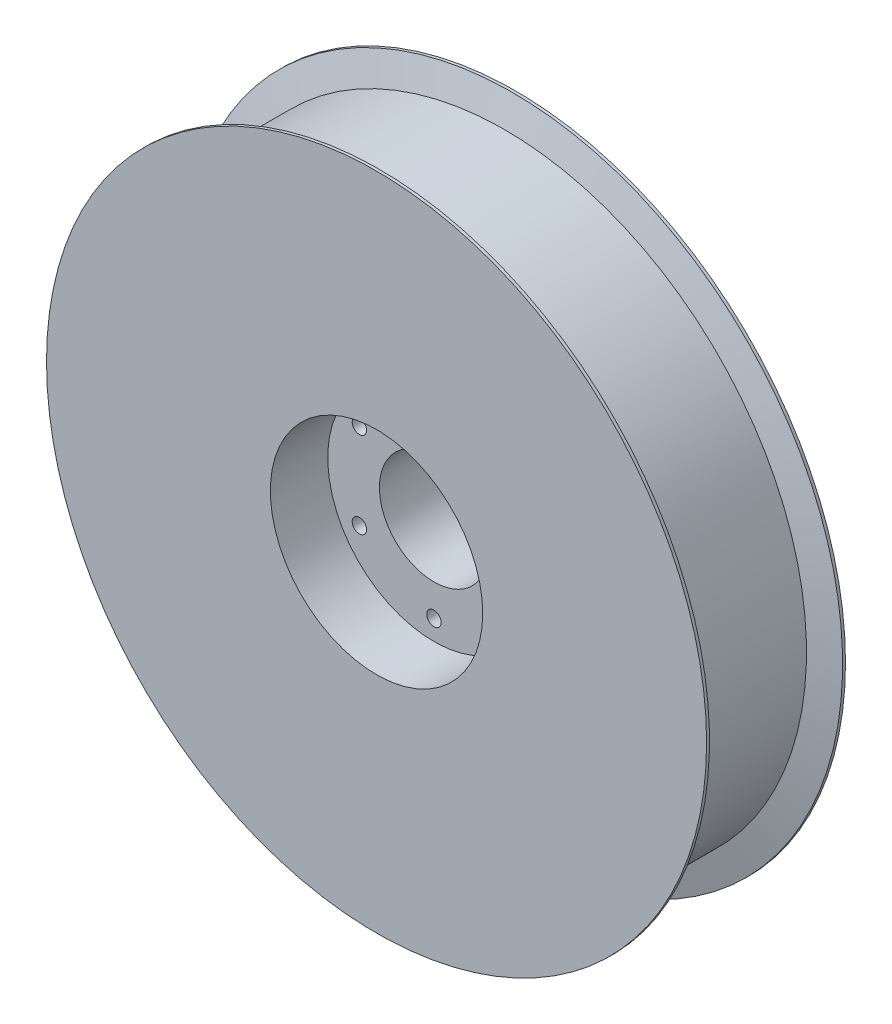
ISO-10303-21;
HEADER;
FILE_DESCRIPTION(('STEP AP214'),'2;1');
FILE_NAME('part.step','',(''),(''),'','','');
FILE_SCHEMA(('AUTOMOTIVE_DESIGN { 1 0 10303 214 1 1 1 1 }'));
ENDSEC;
DATA;
#1=APPLICATION_CONTEXT('core data for automotive mechanical design processes');
#2=APPLICATION_PROTOCOL_DEFINITION('international standard','automotive_design',2000,#1);
#3=PRODUCT_CONTEXT('',#1,'mechanical');
#4=PRODUCT('Part','Part','',(#3));
#5=PRODUCT_RELATED_PRODUCT_CATEGORY('part','',(#4));
#6=PRODUCT_DEFINITION_FORMATION('','',#4);
#7=PRODUCT_DEFINITION_CONTEXT('part definition',#1,'design');
#8=PRODUCT_DEFINITION('design','',#6,#7);
#9=PRODUCT_DEFINITION_SHAPE('','',#8);
#10=(LENGTH_UNIT() NAMED_UNIT(*) SI_UNIT(.MILLI.,.METRE.));
#11=(NAMED_UNIT(*) PLANE_ANGLE_UNIT() SI_UNIT($,.RADIAN.));
#12=(NAMED_UNIT(*) SI_UNIT($,.STERADIAN.) SOLID_ANGLE_UNIT());
#13=UNCERTAINTY_MEASURE_WITH_UNIT(LENGTH_MEASURE(1.E-05),#10,'distance_accuracy_value','');
#14=(GEOMETRIC_REPRESENTATION_CONTEXT(3) GLOBAL_UNCERTAINTY_ASSIGNED_CONTEXT((#13)) GLOBAL_UNIT_ASSIGNED_CONTEXT((#10,
#11,#12)) REPRESENTATION_CONTEXT('',''));
#15=CARTESIAN_POINT('',(0.,0.,0.));
#16=DIRECTION('',(0.,0.,1.));
#17=DIRECTION('',(1.,0.,0.));
#18=AXIS2_PLACEMENT_3D('',#15,#16,#17);
#19=CARTESIAN_POINT('',(0.,0.,24.2));
#20=DIRECTION('',(0.,0.,-1.));
#21=DIRECTION('',(-1.,0.,0.));
#22=AXIS2_PLACEMENT_3D('',#19,#20,#21);
#23=CYLINDRICAL_SURFACE('',#22,57.5);
#24=CARTESIAN_POINT('',(0.,0.,24.2));
#25=DIRECTION('',(0.,0.,1.));
#26=DIRECTION('',(1.,0.,0.));
#27=AXIS2_PLACEMENT_3D('',#24,#25,#26);
#28=CIRCLE('',#27,57.5);
#29=CARTESIAN_POINT('',(57.5,0.,24.2));
#30=VERTEX_POINT('',#29);
#31=EDGE_CURVE('E10',#30,#30,#28,.T.);
#32=ORIENTED_EDGE('',*,*,#31,.F.);
#33=EDGE_LOOP('',(#32));
#34=FACE_BOUND('',#33,.T.);
#35=CARTESIAN_POINT('',(0.,0.,23.7));
#36=DIRECTION('',(0.,0.,-1.));
#37=DIRECTION('',(-1.,0.,0.));
#38=AXIS2_PLACEMENT_3D('',#35,#36,#37);
#39=CIRCLE('',#38,57.5);
#40=CARTESIAN_POINT('',(-57.5,0.,23.7));
#41=VERTEX_POINT('',#40);
#42=EDGE_CURVE('E109',#41,#41,#39,.T.);
#43=ORIENTED_EDGE('',*,*,#42,.F.);
#44=EDGE_LOOP('',(#43));
#45=FACE_BOUND('',#44,.T.);
#46=ADVANCED_FACE('F33',(#34,#45),#23,.T.);
#47=CARTESIAN_POINT('',(0.,0.,0.));
#48=DIRECTION('',(0.,0.,1.));
#49=DIRECTION('',(1.,0.,0.));
#50=AXIS2_PLACEMENT_3D('',#47,#48,#49);
#51=CIRCLE('',#50,57.5);
#52=CARTESIAN_POINT('',(57.5,0.,0.));
#53=VERTEX_POINT('',#52);
#54=EDGE_CURVE('E40',#53,#53,#51,.T.);
#55=ORIENTED_EDGE('',*,*,#54,.T.);
#56=EDGE_LOOP('',(#55));
#57=FACE_BOUND('',#56,.T.);
#58=CARTESIAN_POINT('',(0.,0.,0.5));
#59=DIRECTION('',(0.,0.,-1.));
#60=DIRECTION('',(-1.,0.,0.));
#61=AXIS2_PLACEMENT_3D('',#58,#59,#60);
#62=CIRCLE('',#61,57.5);
#63=CARTESIAN_POINT('',(-57.5,0.,0.5));
#64=VERTEX_POINT('',#63);
#65=EDGE_CURVE('E149',#64,#64,#62,.T.);
#66=ORIENTED_EDGE('',*,*,#65,.T.);
#67=EDGE_LOOP('',(#66));
#68=FACE_BOUND('',#67,.T.);
#69=ADVANCED_FACE('F92',(#57,#68),#23,.T.);
#70=CARTESIAN_POINT('',(0.,0.,24.2));
#71=DIRECTION('',(0.,0.,-1.));
#72=DIRECTION('',(-1.,0.,0.));
#73=AXIS2_PLACEMENT_3D('',#70,#71,#72);
#74=CYLINDRICAL_SURFACE('',#73,9.5);
#75=CARTESIAN_POINT('',(0.,0.,0.));
#76=DIRECTION('',(0.,0.,1.));
#77=DIRECTION('',(1.,0.,0.));
#78=AXIS2_PLACEMENT_3D('',#75,#76,#77);
#79=CIRCLE('',#78,9.5);
#80=CARTESIAN_POINT('',(9.5,0.,0.));
#81=VERTEX_POINT('',#80);
#82=EDGE_CURVE('E45',#81,#81,#79,.T.);
#83=ORIENTED_EDGE('',*,*,#82,.F.);
#84=EDGE_LOOP('',(#83));
#85=FACE_BOUND('',#84,.T.);
#86=CARTESIAN_POINT('',(0.,0.,14.2));
#87=DIRECTION('',(0.,0.,1.));
#88=DIRECTION('',(1.,0.,0.));
#89=AXIS2_PLACEMENT_3D('',#86,#87,#88);
#90=CIRCLE('',#89,9.5);
#91=CARTESIAN_POINT('',(9.5,0.,14.2));
#92=VERTEX_POINT('',#91);
#93=EDGE_CURVE('E67',#92,#92,#90,.T.);
#94=ORIENTED_EDGE('',*,*,#93,.T.);
#95=EDGE_LOOP('',(#94));
#96=FACE_BOUND('',#95,.T.);
#97=ADVANCED_FACE('F89',(#85,#96),#74,.F.);
#98=CARTESIAN_POINT('',(0.,0.,24.2));
#99=DIRECTION('',(0.,0.,1.));
#100=DIRECTION('',(1.,0.,0.));
#101=AXIS2_PLACEMENT_3D('',#98,#99,#100);
#102=PLANE('',#101);
#103=CARTESIAN_POINT('',(0.,0.,24.2));
#104=DIRECTION('',(0.,0.,1.));
#105=DIRECTION('',(1.,0.,0.));
#106=AXIS2_PLACEMENT_3D('',#103,#104,#105);
#107=CIRCLE('',#106,18.5);
#108=CARTESIAN_POINT('',(18.5,0.,24.2));
#109=VERTEX_POINT('',#108);
#110=EDGE_CURVE('E71',#109,#109,#107,.T.);
#111=ORIENTED_EDGE('',*,*,#110,.F.);
#112=EDGE_LOOP('',(#111));
#113=FACE_BOUND('',#112,.T.);
#114=ORIENTED_EDGE('',*,*,#31,.T.);
#115=EDGE_LOOP('',(#114));
#116=FACE_BOUND('',#115,.T.);
#117=ADVANCED_FACE('F91',(#113,#116),#102,.T.);
#118=CARTESIAN_POINT('',(0.,0.,0.));
#119=DIRECTION('',(0.,0.,1.));
#120=DIRECTION('',(1.,0.,0.));
#121=AXIS2_PLACEMENT_3D('',#118,#119,#120);
#122=PLANE('',#121);
#123=CARTESIAN_POINT('',(0.,15.,0.));
#124=DIRECTION('',(0.,0.,-1.));
#125=DIRECTION('',(-1.,0.,0.));
#126=AXIS2_PLACEMENT_3D('',#123,#124,#125);
#127=CIRCLE('',#126,1.25);
#128=CARTESIAN_POINT('',(-1.25,15.,0.));
#129=VERTEX_POINT('',#128);
#130=EDGE_CURVE('E54',#129,#129,#127,.T.);
#131=ORIENTED_EDGE('',*,*,#130,.F.);
#132=EDGE_LOOP('',(#131));
#133=FACE_BOUND('',#132,.T.);
#134=CARTESIAN_POINT('',(12.9903810567665,7.50000000000015,0.));
#135=DIRECTION('',(0.,0.,-1.));
#136=DIRECTION('',(-1.,0.,0.));
#137=AXIS2_PLACEMENT_3D('',#134,#135,#136);
#138=CIRCLE('',#137,1.25);
#139=CARTESIAN_POINT('',(11.7403810567665,7.50000000000015,0.));
#140=VERTEX_POINT('',#139);
#141=EDGE_CURVE('E111',#140,#140,#138,.T.);
#142=ORIENTED_EDGE('',*,*,#141,.F.);
#143=EDGE_LOOP('',(#142));
#144=FACE_BOUND('',#143,.T.);
#145=CARTESIAN_POINT('',(-12.9903810567665,-7.50000000000006,0.));
#146=DIRECTION('',(0.,0.,-1.));
#147=DIRECTION('',(-1.,0.,0.));
#148=AXIS2_PLACEMENT_3D('',#145,#146,#147);
#149=CIRCLE('',#148,1.25);
#150=CARTESIAN_POINT('',(-14.2403810567665,-7.50000000000006,0.));
#151=VERTEX_POINT('',#150);
#152=EDGE_CURVE('E123',#151,#151,#149,.T.);
#153=ORIENTED_EDGE('',*,*,#152,.F.);
#154=EDGE_LOOP('',(#153));
#155=FACE_BOUND('',#154,.T.);
#156=CARTESIAN_POINT('',(12.9903810567667,-7.49999999999988,0.));
#157=DIRECTION('',(0.,0.,-1.));
#158=DIRECTION('',(-1.,0.,0.));
#159=AXIS2_PLACEMENT_3D('',#156,#157,#158);
#160=CIRCLE('',#159,1.25);
#161=CARTESIAN_POINT('',(11.7403810567666,-7.49999999999988,0.));
#162=VERTEX_POINT('',#161);
#163=EDGE_CURVE('E79',#162,#162,#160,.T.);
#164=ORIENTED_EDGE('',*,*,#163,.F.);
#165=EDGE_LOOP('',(#164));
#166=FACE_BOUND('',#165,.T.);
#167=CARTESIAN_POINT('',(-12.9903810567666,7.49999999999997,0.));
#168=DIRECTION('',(0.,0.,-1.));
#169=DIRECTION('',(-1.,0.,0.));
#170=AXIS2_PLACEMENT_3D('',#167,#168,#169);
#171=CIRCLE('',#170,1.25);
#172=CARTESIAN_POINT('',(-14.2403810567666,7.49999999999997,0.));
#173=VERTEX_POINT('',#172);
#174=EDGE_CURVE('E125',#173,#173,#171,.T.);
#175=ORIENTED_EDGE('',*,*,#174,.F.);
#176=EDGE_LOOP('',(#175));
#177=FACE_BOUND('',#176,.T.);
#178=CARTESIAN_POINT('',(1.04916075827077E-13,-15.,0.));
#179=DIRECTION('',(0.,0.,-1.));
#180=DIRECTION('',(-1.,0.,0.));
#181=AXIS2_PLACEMENT_3D('',#178,#179,#180);
#182=CIRCLE('',#181,1.25);
#183=CARTESIAN_POINT('',(-1.24999999999989,-15.,0.));
#184=VERTEX_POINT('',#183);
#185=EDGE_CURVE('E115',#184,#184,#182,.T.);
#186=ORIENTED_EDGE('',*,*,#185,.F.);
#187=EDGE_LOOP('',(#186));
#188=FACE_BOUND('',#187,.T.);
#189=ORIENTED_EDGE('',*,*,#54,.F.);
#190=EDGE_LOOP('',(#189));
#191=FACE_BOUND('',#190,.T.);
#192=ORIENTED_EDGE('',*,*,#82,.T.);
#193=EDGE_LOOP('',(#192));
#194=FACE_BOUND('',#193,.T.);
#195=ADVANCED_FACE('F87',(#133,#144,#155,#166,#177,#188,#191,#194),#122,.F.);
#196=CARTESIAN_POINT('',(0.,0.,14.2));
#197=DIRECTION('',(0.,0.,1.));
#198=DIRECTION('',(1.,0.,0.));
#199=AXIS2_PLACEMENT_3D('',#196,#197,#198);
#200=CYLINDRICAL_SURFACE('',#199,18.5);
#201=CARTESIAN_POINT('',(0.,0.,14.2));
#202=DIRECTION('',(0.,0.,1.));
#203=DIRECTION('',(1.,0.,0.));
#204=AXIS2_PLACEMENT_3D('',#201,#202,#203);
#205=CIRCLE('',#204,18.5);
#206=CARTESIAN_POINT('',(18.5,0.,14.2));
#207=VERTEX_POINT('',#206);
#208=EDGE_CURVE('E76',#207,#207,#205,.T.);
#209=ORIENTED_EDGE('',*,*,#208,.F.);
#210=EDGE_LOOP('',(#209));
#211=FACE_BOUND('',#210,.T.);
#212=ORIENTED_EDGE('',*,*,#110,.T.);
#213=EDGE_LOOP('',(#212));
#214=FACE_BOUND('',#213,.T.);
#215=ADVANCED_FACE('F139',(#211,#214),#200,.F.);
#216=CARTESIAN_POINT('',(0.,0.,14.2));
#217=DIRECTION('',(0.,0.,1.));
#218=DIRECTION('',(1.,0.,0.));
#219=AXIS2_PLACEMENT_3D('',#216,#217,#218);
#220=PLANE('',#219);
#221=CARTESIAN_POINT('',(0.,15.,14.2));
#222=DIRECTION('',(0.,0.,1.));
#223=DIRECTION('',(1.,0.,0.));
#224=AXIS2_PLACEMENT_3D('',#221,#222,#223);
#225=CIRCLE('',#224,1.25);
#226=CARTESIAN_POINT('',(1.25,15.,14.2));
#227=VERTEX_POINT('',#226);
#228=EDGE_CURVE('E36',#227,#227,#225,.T.);
#229=ORIENTED_EDGE('',*,*,#228,.F.);
#230=EDGE_LOOP('',(#229));
#231=FACE_BOUND('',#230,.T.);
#232=CARTESIAN_POINT('',(12.9903810567665,7.50000000000015,14.2));
#233=DIRECTION('',(0.,0.,1.));
#234=DIRECTION('',(1.,0.,0.));
#235=AXIS2_PLACEMENT_3D('',#232,#233,#234);
#236=CIRCLE('',#235,1.25);
#237=CARTESIAN_POINT('',(14.2403810567665,7.50000000000015,14.2));
#238=VERTEX_POINT('',#237);
#239=EDGE_CURVE('E62',#238,#238,#236,.T.);
#240=ORIENTED_EDGE('',*,*,#239,.F.);
#241=EDGE_LOOP('',(#240));
#242=FACE_BOUND('',#241,.T.);
#243=CARTESIAN_POINT('',(-12.9903810567665,-7.50000000000006,14.2));
#244=DIRECTION('',(0.,0.,1.));
#245=DIRECTION('',(1.,0.,0.));
#246=AXIS2_PLACEMENT_3D('',#243,#244,#245);
#247=CIRCLE('',#246,1.25);
#248=CARTESIAN_POINT('',(-11.7403810567665,-7.50000000000006,14.2));
#249=VERTEX_POINT('',#248);
#250=EDGE_CURVE('E60',#249,#249,#247,.T.);
#251=ORIENTED_EDGE('',*,*,#250,.F.);
#252=EDGE_LOOP('',(#251));
#253=FACE_BOUND('',#252,.T.);
#254=CARTESIAN_POINT('',(12.9903810567667,-7.49999999999988,14.2));
#255=DIRECTION('',(0.,0.,1.));
#256=DIRECTION('',(1.,0.,0.));
#257=AXIS2_PLACEMENT_3D('',#254,#255,#256);
#258=CIRCLE('',#257,1.25);
#259=CARTESIAN_POINT('',(14.2403810567667,-7.49999999999988,14.2));
#260=VERTEX_POINT('',#259);
#261=EDGE_CURVE('E57',#260,#260,#258,.T.);
#262=ORIENTED_EDGE('',*,*,#261,.F.);
#263=EDGE_LOOP('',(#262));
#264=FACE_BOUND('',#263,.T.);
#265=CARTESIAN_POINT('',(-12.9903810567666,7.49999999999997,14.2));
#266=DIRECTION('',(0.,0.,1.));
#267=DIRECTION('',(1.,0.,0.));
#268=AXIS2_PLACEMENT_3D('',#265,#266,#267);
#269=CIRCLE('',#268,1.25);
#270=CARTESIAN_POINT('',(-11.7403810567666,7.49999999999997,14.2));
#271=VERTEX_POINT('',#270);
#272=EDGE_CURVE('E53',#271,#271,#269,.T.);
#273=ORIENTED_EDGE('',*,*,#272,.F.);
#274=EDGE_LOOP('',(#273));
#275=FACE_BOUND('',#274,.T.);
#276=CARTESIAN_POINT('',(1.04916075827077E-13,-15.,14.2));
#277=DIRECTION('',(0.,0.,1.));
#278=DIRECTION('',(1.,0.,0.));
#279=AXIS2_PLACEMENT_3D('',#276,#277,#278);
#280=CIRCLE('',#279,1.25);
#281=CARTESIAN_POINT('',(1.25000000000011,-15.,14.2));
#282=VERTEX_POINT('',#281);
#283=EDGE_CURVE('E50',#282,#282,#280,.T.);
#284=ORIENTED_EDGE('',*,*,#283,.F.);
#285=EDGE_LOOP('',(#284));
#286=FACE_BOUND('',#285,.T.);
#287=ORIENTED_EDGE('',*,*,#93,.F.);
#288=EDGE_LOOP('',(#287));
#289=FACE_BOUND('',#288,.T.);
#290=ORIENTED_EDGE('',*,*,#208,.T.);
#291=EDGE_LOOP('',(#290));
#292=FACE_BOUND('',#291,.T.);
#293=ADVANCED_FACE('F183',(#231,#242,#253,#264,#275,#286,#289,#292),#220,.T.);
#294=CARTESIAN_POINT('',(1.04916075827077E-13,-15.,24.2));
#295=DIRECTION('',(0.,0.,-1.));
#296=DIRECTION('',(-1.,0.,0.));
#297=AXIS2_PLACEMENT_3D('',#294,#295,#296);
#298=CYLINDRICAL_SURFACE('',#297,1.25);
#299=ORIENTED_EDGE('',*,*,#283,.T.);
#300=EDGE_LOOP('',(#299));
#301=FACE_BOUND('',#300,.T.);
#302=ORIENTED_EDGE('',*,*,#185,.T.);
#303=EDGE_LOOP('',(#302));
#304=FACE_BOUND('',#303,.T.);
#305=ADVANCED_FACE('F179',(#301,#304),#298,.F.);
#306=CARTESIAN_POINT('',(-12.9903810567666,7.49999999999997,24.2));
#307=DIRECTION('',(0.,0.,-1.));
#308=DIRECTION('',(-1.,0.,0.));
#309=AXIS2_PLACEMENT_3D('',#306,#307,#308);
#310=CYLINDRICAL_SURFACE('',#309,1.25);
#311=ORIENTED_EDGE('',*,*,#272,.T.);
#312=EDGE_LOOP('',(#311));
#313=FACE_BOUND('',#312,.T.);
#314=ORIENTED_EDGE('',*,*,#174,.T.);
#315=EDGE_LOOP('',(#314));
#316=FACE_BOUND('',#315,.T.);
#317=ADVANCED_FACE('F176',(#313,#316),#310,.F.);
#318=CARTESIAN_POINT('',(12.9903810567667,-7.49999999999988,24.2));
#319=DIRECTION('',(0.,0.,-1.));
#320=DIRECTION('',(-1.,0.,0.));
#321=AXIS2_PLACEMENT_3D('',#318,#319,#320);
#322=CYLINDRICAL_SURFACE('',#321,1.25);
#323=ORIENTED_EDGE('',*,*,#261,.T.);
#324=EDGE_LOOP('',(#323));
#325=FACE_BOUND('',#324,.T.);
#326=ORIENTED_EDGE('',*,*,#163,.T.);
#327=EDGE_LOOP('',(#326));
#328=FACE_BOUND('',#327,.T.);
#329=ADVANCED_FACE('F135',(#325,#328),#322,.F.);
#330=CARTESIAN_POINT('',(-12.9903810567665,-7.50000000000006,24.2));
#331=DIRECTION('',(0.,0.,-1.));
#332=DIRECTION('',(-1.,0.,0.));
#333=AXIS2_PLACEMENT_3D('',#330,#331,#332);
#334=CYLINDRICAL_SURFACE('',#333,1.25);
#335=ORIENTED_EDGE('',*,*,#250,.T.);
#336=EDGE_LOOP('',(#335));
#337=FACE_BOUND('',#336,.T.);
#338=ORIENTED_EDGE('',*,*,#152,.T.);
#339=EDGE_LOOP('',(#338));
#340=FACE_BOUND('',#339,.T.);
#341=ADVANCED_FACE('F175',(#337,#340),#334,.F.);
#342=CARTESIAN_POINT('',(12.9903810567665,7.50000000000015,24.2));
#343=DIRECTION('',(0.,0.,-1.));
#344=DIRECTION('',(-1.,0.,0.));
#345=AXIS2_PLACEMENT_3D('',#342,#343,#344);
#346=CYLINDRICAL_SURFACE('',#345,1.25);
#347=ORIENTED_EDGE('',*,*,#239,.T.);
#348=EDGE_LOOP('',(#347));
#349=FACE_BOUND('',#348,.T.);
#350=ORIENTED_EDGE('',*,*,#141,.T.);
#351=EDGE_LOOP('',(#350));
#352=FACE_BOUND('',#351,.T.);
#353=ADVANCED_FACE('F172',(#349,#352),#346,.F.);
#354=CARTESIAN_POINT('',(0.,15.,24.2));
#355=DIRECTION('',(0.,0.,-1.));
#356=DIRECTION('',(-1.,0.,0.));
#357=AXIS2_PLACEMENT_3D('',#354,#355,#356);
#358=CYLINDRICAL_SURFACE('',#357,1.25);
#359=ORIENTED_EDGE('',*,*,#228,.T.);
#360=EDGE_LOOP('',(#359));
#361=FACE_BOUND('',#360,.T.);
#362=ORIENTED_EDGE('',*,*,#130,.T.);
#363=EDGE_LOOP('',(#362));
#364=FACE_BOUND('',#363,.T.);
#365=ADVANCED_FACE('F167',(#361,#364),#358,.F.);
#366=CARTESIAN_POINT('',(0.,0.,22.35));
#367=DIRECTION('',(0.,0.,1.));
#368=DIRECTION('',(1.,0.,0.));
#369=AXIS2_PLACEMENT_3D('',#366,#367,#368);
#370=CONICAL_SURFACE('',#369,52.555,1.30428762609686);
#371=ORIENTED_EDGE('',*,*,#42,.T.);
#372=EDGE_LOOP('',(#371));
#373=FACE_BOUND('',#372,.T.);
#374=CARTESIAN_POINT('',(0.,0.,22.35));
#375=DIRECTION('',(0.,0.,-1.));
#376=DIRECTION('',(-1.,0.,0.));
#377=AXIS2_PLACEMENT_3D('',#374,#375,#376);
#378=CIRCLE('',#377,52.555);
#379=CARTESIAN_POINT('',(-52.555,0.,22.35));
#380=VERTEX_POINT('',#379);
#381=EDGE_CURVE('E112',#380,#380,#378,.T.);
#382=ORIENTED_EDGE('',*,*,#381,.F.);
#383=EDGE_LOOP('',(#382));
#384=FACE_BOUND('',#383,.T.);
#385=ADVANCED_FACE('F159',(#373,#384),#370,.T.);
#386=CARTESIAN_POINT('',(0.,0.,0.));
#387=DIRECTION('',(0.,0.,-1.));
#388=DIRECTION('',(-1.,0.,0.));
#389=AXIS2_PLACEMENT_3D('',#386,#387,#388);
#390=CYLINDRICAL_SURFACE('',#389,52.555);
#391=ORIENTED_EDGE('',*,*,#381,.T.);
#392=EDGE_LOOP('',(#391));
#393=FACE_BOUND('',#392,.T.);
#394=CARTESIAN_POINT('',(0.,0.,1.85));
#395=DIRECTION('',(0.,0.,-1.));
#396=DIRECTION('',(-1.,0.,0.));
#397=AXIS2_PLACEMENT_3D('',#394,#395,#396);
#398=CIRCLE('',#397,52.555);
#399=CARTESIAN_POINT('',(-52.555,0.,1.85));
#400=VERTEX_POINT('',#399);
#401=EDGE_CURVE('E118',#400,#400,#398,.T.);
#402=ORIENTED_EDGE('',*,*,#401,.F.);
#403=EDGE_LOOP('',(#402));
#404=FACE_BOUND('',#403,.T.);
#405=ADVANCED_FACE('F157',(#393,#404),#390,.T.);
#406=CARTESIAN_POINT('',(0.,0.,0.5));
#407=DIRECTION('',(0.,0.,-1.));
#408=DIRECTION('',(-1.,0.,0.));
#409=AXIS2_PLACEMENT_3D('',#406,#407,#408);
#410=CONICAL_SURFACE('',#409,57.5,1.30428762609686);
#411=ORIENTED_EDGE('',*,*,#401,.T.);
#412=EDGE_LOOP('',(#411));
#413=FACE_BOUND('',#412,.T.);
#414=ORIENTED_EDGE('',*,*,#65,.F.);
#415=EDGE_LOOP('',(#414));
#416=FACE_BOUND('',#415,.T.);
#417=ADVANCED_FACE('F155',(#413,#416),#410,.T.);
#418=CLOSED_SHELL('',(#46,#69,#97,#117,#195,#215,#293,#305,#317,#329,#341,#353,#365,#385,#405,#417));
#419=MANIFOLD_SOLID_BREP('B2',#418);
#420=ADVANCED_BREP_SHAPE_REPRESENTATION('',(#18,#419),#14);
#421=SHAPE_DEFINITION_REPRESENTATION(#9,#420);
ENDSEC;
END-ISO-10303-21;
